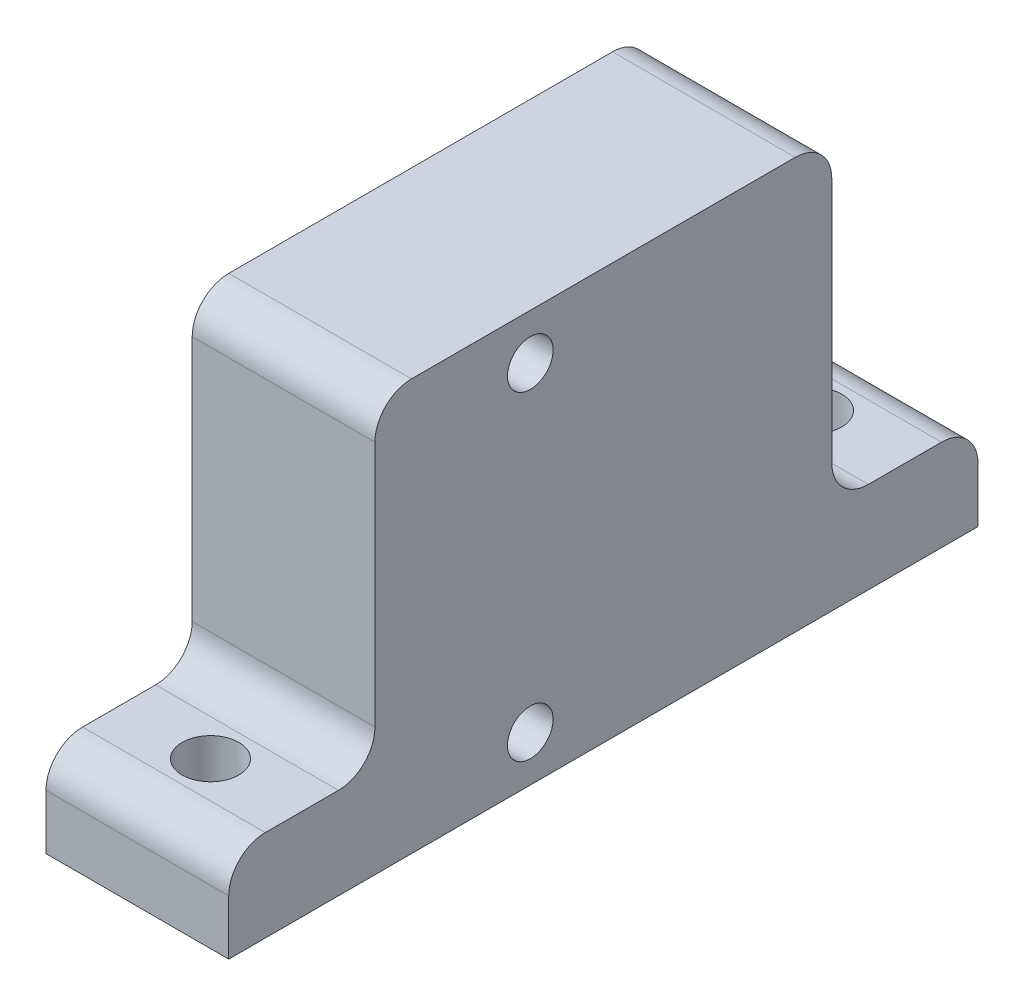
ISO-10303-21;
HEADER;
FILE_DESCRIPTION(('STEP AP214'),'2;1');
FILE_NAME('part.step','',(''),(''),'','','');
FILE_SCHEMA(('AUTOMOTIVE_DESIGN { 1 0 10303 214 1 1 1 1 }'));
ENDSEC;
DATA;
#1=APPLICATION_CONTEXT('core data for automotive mechanical design processes');
#2=APPLICATION_PROTOCOL_DEFINITION('international standard','automotive_design',2000,#1);
#3=PRODUCT_CONTEXT('',#1,'mechanical');
#4=PRODUCT('Part','Part','',(#3));
#5=PRODUCT_RELATED_PRODUCT_CATEGORY('part','',(#4));
#6=PRODUCT_DEFINITION_FORMATION('','',#4);
#7=PRODUCT_DEFINITION_CONTEXT('part definition',#1,'design');
#8=PRODUCT_DEFINITION('design','',#6,#7);
#9=PRODUCT_DEFINITION_SHAPE('','',#8);
#10=(LENGTH_UNIT() NAMED_UNIT(*) SI_UNIT(.MILLI.,.METRE.));
#11=(NAMED_UNIT(*) PLANE_ANGLE_UNIT() SI_UNIT($,.RADIAN.));
#12=(NAMED_UNIT(*) SI_UNIT($,.STERADIAN.) SOLID_ANGLE_UNIT());
#13=UNCERTAINTY_MEASURE_WITH_UNIT(LENGTH_MEASURE(1.E-05),#10,'distance_accuracy_value','');
#14=(GEOMETRIC_REPRESENTATION_CONTEXT(3) GLOBAL_UNCERTAINTY_ASSIGNED_CONTEXT((#13)) GLOBAL_UNIT_ASSIGNED_CONTEXT((#10,
#11,#12)) REPRESENTATION_CONTEXT('',''));
#15=CARTESIAN_POINT('',(0.,0.,0.));
#16=DIRECTION('',(0.,0.,1.));
#17=DIRECTION('',(1.,0.,0.));
#18=AXIS2_PLACEMENT_3D('',#15,#16,#17);
#19=CARTESIAN_POINT('',(10.,11.25,8.5));
#20=DIRECTION('',(0.,0.,-1.));
#21=DIRECTION('',(0.,1.,0.));
#22=AXIS2_PLACEMENT_3D('',#19,#20,#21);
#23=PLANE('',#22);
#24=DIRECTION('',(0.,-1.,0.));
#25=VECTOR('',#24,1.);
#26=CARTESIAN_POINT('',(0.,11.25,8.5));
#27=LINE('',#26,#25);
#28=CARTESIAN_POINT('',(0.,9.25,8.5));
#29=VERTEX_POINT('',#28);
#30=CARTESIAN_POINT('',(0.,-4.24999999999999,8.5));
#31=VERTEX_POINT('',#30);
#32=EDGE_CURVE('E158',#29,#31,#27,.T.);
#33=ORIENTED_EDGE('',*,*,#32,.T.);
#34=DIRECTION('',(-1.,0.,0.));
#35=VECTOR('',#34,1.);
#36=CARTESIAN_POINT('',(10.,-4.25,8.5));
#37=LINE('',#36,#35);
#38=CARTESIAN_POINT('',(10.,-4.24999999999999,8.5));
#39=VERTEX_POINT('',#38);
#40=EDGE_CURVE('E296',#31,#39,#37,.F.);
#41=ORIENTED_EDGE('',*,*,#40,.T.);
#42=DIRECTION('',(0.,-1.,0.));
#43=VECTOR('',#42,1.);
#44=CARTESIAN_POINT('',(10.,11.25,8.5));
#45=LINE('',#44,#43);
#46=CARTESIAN_POINT('',(10.,9.25,8.5));
#47=VERTEX_POINT('',#46);
#48=EDGE_CURVE('E273',#47,#39,#45,.T.);
#49=ORIENTED_EDGE('',*,*,#48,.F.);
#50=DIRECTION('',(-1.,0.,0.));
#51=VECTOR('',#50,1.);
#52=CARTESIAN_POINT('',(10.,9.25,8.5));
#53=LINE('',#52,#51);
#54=EDGE_CURVE('E272',#47,#29,#53,.T.);
#55=ORIENTED_EDGE('',*,*,#54,.T.);
#56=EDGE_LOOP('',(#33,#41,#49,#55));
#57=FACE_BOUND('',#56,.T.);
#58=ADVANCED_FACE('F33',(#57),#23,.F.);
#59=CARTESIAN_POINT('',(10.,11.25,-16.5));
#60=DIRECTION('',(0.,0.,1.));
#61=DIRECTION('',(1.,0.,0.));
#62=AXIS2_PLACEMENT_3D('',#59,#60,#61);
#63=PLANE('',#62);
#64=DIRECTION('',(0.,1.,0.));
#65=VECTOR('',#64,1.);
#66=CARTESIAN_POINT('',(10.,11.25,-16.5));
#67=LINE('',#66,#65);
#68=CARTESIAN_POINT('',(10.,-4.24999999999999,-16.5));
#69=VERTEX_POINT('',#68);
#70=CARTESIAN_POINT('',(10.,9.25,-16.5));
#71=VERTEX_POINT('',#70);
#72=EDGE_CURVE('E157',#69,#71,#67,.T.);
#73=ORIENTED_EDGE('',*,*,#72,.F.);
#74=DIRECTION('',(1.,0.,0.));
#75=VECTOR('',#74,1.);
#76=CARTESIAN_POINT('',(0.,-4.25,-16.5));
#77=LINE('',#76,#75);
#78=CARTESIAN_POINT('',(0.,-4.24999999999999,-16.5));
#79=VERTEX_POINT('',#78);
#80=EDGE_CURVE('E217',#69,#79,#77,.F.);
#81=ORIENTED_EDGE('',*,*,#80,.T.);
#82=DIRECTION('',(0.,1.,0.));
#83=VECTOR('',#82,1.);
#84=CARTESIAN_POINT('',(0.,11.25,-16.5));
#85=LINE('',#84,#83);
#86=CARTESIAN_POINT('',(0.,9.25,-16.5));
#87=VERTEX_POINT('',#86);
#88=EDGE_CURVE('E187',#79,#87,#85,.T.);
#89=ORIENTED_EDGE('',*,*,#88,.T.);
#90=DIRECTION('',(-1.,0.,0.));
#91=VECTOR('',#90,1.);
#92=CARTESIAN_POINT('',(10.,9.25,-16.5));
#93=LINE('',#92,#91);
#94=EDGE_CURVE('E215',#87,#71,#93,.F.);
#95=ORIENTED_EDGE('',*,*,#94,.T.);
#96=EDGE_LOOP('',(#73,#81,#89,#95));
#97=FACE_BOUND('',#96,.T.);
#98=ADVANCED_FACE('F236',(#97),#63,.F.);
#99=CARTESIAN_POINT('',(10.,0.,0.));
#100=DIRECTION('',(1.,0.,0.));
#101=DIRECTION('',(0.,0.,-1.));
#102=AXIS2_PLACEMENT_3D('',#99,#100,#101);
#103=PLANE('',#102);
#104=CARTESIAN_POINT('',(10.,8.75,0.));
#105=DIRECTION('',(1.,0.,0.));
#106=DIRECTION('',(0.,0.,-1.));
#107=AXIS2_PLACEMENT_3D('',#104,#105,#106);
#108=CIRCLE('',#107,1.25);
#109=CARTESIAN_POINT('',(10.,8.75,-1.25));
#110=VERTEX_POINT('',#109);
#111=EDGE_CURVE('E184',#110,#110,#108,.T.);
#112=ORIENTED_EDGE('',*,*,#111,.F.);
#113=EDGE_LOOP('',(#112));
#114=FACE_BOUND('',#113,.T.);
#115=DIRECTION('',(0.,0.,-1.));
#116=VECTOR('',#115,1.);
#117=CARTESIAN_POINT('',(10.,-6.25,16.5));
#118=LINE('',#117,#116);
#119=CARTESIAN_POINT('',(10.,-6.25,14.5));
#120=VERTEX_POINT('',#119);
#121=CARTESIAN_POINT('',(10.,-6.25,10.5));
#122=VERTEX_POINT('',#121);
#123=EDGE_CURVE('E172',#120,#122,#118,.T.);
#124=ORIENTED_EDGE('',*,*,#123,.F.);
#125=CARTESIAN_POINT('',(10.,-8.25,14.5));
#126=DIRECTION('',(1.,0.,0.));
#127=DIRECTION('',(0.,0.,-1.));
#128=AXIS2_PLACEMENT_3D('',#125,#126,#127);
#129=CIRCLE('',#128,2.);
#130=CARTESIAN_POINT('',(10.,-8.25,16.5));
#131=VERTEX_POINT('',#130);
#132=EDGE_CURVE('E205',#120,#131,#129,.T.);
#133=ORIENTED_EDGE('',*,*,#132,.T.);
#134=DIRECTION('',(0.,1.,0.));
#135=VECTOR('',#134,1.);
#136=CARTESIAN_POINT('',(10.,-11.25,16.5));
#137=LINE('',#136,#135);
#138=CARTESIAN_POINT('',(10.,-11.25,16.5));
#139=VERTEX_POINT('',#138);
#140=EDGE_CURVE('E163',#139,#131,#137,.T.);
#141=ORIENTED_EDGE('',*,*,#140,.F.);
#142=DIRECTION('',(0.,0.,-1.));
#143=VECTOR('',#142,1.);
#144=CARTESIAN_POINT('',(10.,-11.25,8.49999999999999));
#145=LINE('',#144,#143);
#146=CARTESIAN_POINT('',(10.,-11.25,-24.5));
#147=VERTEX_POINT('',#146);
#148=EDGE_CURVE('E162',#139,#147,#145,.T.);
#149=ORIENTED_EDGE('',*,*,#148,.T.);
#150=DIRECTION('',(0.,-1.,0.));
#151=VECTOR('',#150,1.);
#152=CARTESIAN_POINT('',(10.,-11.25,-24.5));
#153=LINE('',#152,#151);
#154=CARTESIAN_POINT('',(10.,-8.25,-24.5));
#155=VERTEX_POINT('',#154);
#156=EDGE_CURVE('E169',#155,#147,#153,.T.);
#157=ORIENTED_EDGE('',*,*,#156,.F.);
#158=CARTESIAN_POINT('',(10.,-8.25,-22.5));
#159=DIRECTION('',(1.,0.,0.));
#160=DIRECTION('',(0.,0.,-1.));
#161=AXIS2_PLACEMENT_3D('',#158,#159,#160);
#162=CIRCLE('',#161,2.);
#163=CARTESIAN_POINT('',(10.,-6.25,-22.5));
#164=VERTEX_POINT('',#163);
#165=EDGE_CURVE('E203',#155,#164,#162,.T.);
#166=ORIENTED_EDGE('',*,*,#165,.T.);
#167=DIRECTION('',(0.,0.,1.));
#168=VECTOR('',#167,1.);
#169=CARTESIAN_POINT('',(10.,-6.25,-24.5));
#170=LINE('',#169,#168);
#171=CARTESIAN_POINT('',(10.,-6.25,-18.5));
#172=VERTEX_POINT('',#171);
#173=EDGE_CURVE('E175',#164,#172,#170,.T.);
#174=ORIENTED_EDGE('',*,*,#173,.T.);
#175=CARTESIAN_POINT('',(10.,-4.25,-18.5));
#176=DIRECTION('',(1.,0.,0.));
#177=DIRECTION('',(0.,0.,-1.));
#178=AXIS2_PLACEMENT_3D('',#175,#176,#177);
#179=CIRCLE('',#178,2.);
#180=EDGE_CURVE('E41',#172,#69,#179,.F.);
#181=ORIENTED_EDGE('',*,*,#180,.T.);
#182=ORIENTED_EDGE('',*,*,#72,.T.);
#183=CARTESIAN_POINT('',(10.,9.25,-14.5));
#184=DIRECTION('',(1.,0.,0.));
#185=DIRECTION('',(0.,0.,-1.));
#186=AXIS2_PLACEMENT_3D('',#183,#184,#185);
#187=CIRCLE('',#186,2.);
#188=CARTESIAN_POINT('',(10.,11.25,-14.5));
#189=VERTEX_POINT('',#188);
#190=EDGE_CURVE('E55',#71,#189,#187,.T.);
#191=ORIENTED_EDGE('',*,*,#190,.T.);
#192=DIRECTION('',(0.,0.,1.));
#193=VECTOR('',#192,1.);
#194=CARTESIAN_POINT('',(10.,11.25,8.5));
#195=LINE('',#194,#193);
#196=CARTESIAN_POINT('',(10.,11.25,6.5));
#197=VERTEX_POINT('',#196);
#198=EDGE_CURVE('E192',#189,#197,#195,.T.);
#199=ORIENTED_EDGE('',*,*,#198,.T.);
#200=CARTESIAN_POINT('',(10.,9.25,6.5));
#201=DIRECTION('',(1.,0.,0.));
#202=DIRECTION('',(0.,0.,-1.));
#203=AXIS2_PLACEMENT_3D('',#200,#201,#202);
#204=CIRCLE('',#203,2.);
#205=EDGE_CURVE('E199',#197,#47,#204,.T.);
#206=ORIENTED_EDGE('',*,*,#205,.T.);
#207=ORIENTED_EDGE('',*,*,#48,.T.);
#208=CARTESIAN_POINT('',(10.,-4.25,10.5));
#209=DIRECTION('',(1.,0.,0.));
#210=DIRECTION('',(0.,0.,-1.));
#211=AXIS2_PLACEMENT_3D('',#208,#209,#210);
#212=CIRCLE('',#211,2.);
#213=EDGE_CURVE('E225',#39,#122,#212,.F.);
#214=ORIENTED_EDGE('',*,*,#213,.T.);
#215=EDGE_LOOP('',(#124,#133,#141,#149,#157,#166,#174,#181,#182,#191,#199,#206,#207,#214));
#216=FACE_BOUND('',#215,.T.);
#217=CARTESIAN_POINT('',(10.,-8.75,0.));
#218=DIRECTION('',(1.,0.,0.));
#219=DIRECTION('',(0.,0.,-1.));
#220=AXIS2_PLACEMENT_3D('',#217,#218,#219);
#221=CIRCLE('',#220,1.25);
#222=CARTESIAN_POINT('',(10.,-8.75,-1.25));
#223=VERTEX_POINT('',#222);
#224=EDGE_CURVE('E176',#223,#223,#221,.T.);
#225=ORIENTED_EDGE('',*,*,#224,.F.);
#226=EDGE_LOOP('',(#225));
#227=FACE_BOUND('',#226,.T.);
#228=ADVANCED_FACE('F229',(#114,#216,#227),#103,.T.);
#229=CARTESIAN_POINT('',(0.,0.,0.));
#230=DIRECTION('',(1.,0.,0.));
#231=DIRECTION('',(0.,0.,-1.));
#232=AXIS2_PLACEMENT_3D('',#229,#230,#231);
#233=PLANE('',#232);
#234=DIRECTION('',(0.,-1.,0.));
#235=VECTOR('',#234,1.);
#236=CARTESIAN_POINT('',(0.,-11.25,16.5));
#237=LINE('',#236,#235);
#238=CARTESIAN_POINT('',(0.,-8.25,16.5));
#239=VERTEX_POINT('',#238);
#240=CARTESIAN_POINT('',(0.,-11.25,16.5));
#241=VERTEX_POINT('',#240);
#242=EDGE_CURVE('E136',#239,#241,#237,.T.);
#243=ORIENTED_EDGE('',*,*,#242,.F.);
#244=CARTESIAN_POINT('',(0.,-8.25,14.5));
#245=DIRECTION('',(1.,0.,0.));
#246=DIRECTION('',(0.,0.,-1.));
#247=AXIS2_PLACEMENT_3D('',#244,#245,#246);
#248=CIRCLE('',#247,2.);
#249=CARTESIAN_POINT('',(0.,-6.25,14.5));
#250=VERTEX_POINT('',#249);
#251=EDGE_CURVE('E201',#239,#250,#248,.F.);
#252=ORIENTED_EDGE('',*,*,#251,.T.);
#253=DIRECTION('',(0.,0.,-1.));
#254=VECTOR('',#253,1.);
#255=CARTESIAN_POINT('',(0.,-6.25,16.5));
#256=LINE('',#255,#254);
#257=CARTESIAN_POINT('',(0.,-6.25,10.5));
#258=VERTEX_POINT('',#257);
#259=EDGE_CURVE('E165',#250,#258,#256,.T.);
#260=ORIENTED_EDGE('',*,*,#259,.T.);
#261=CARTESIAN_POINT('',(0.,-4.25,10.5));
#262=DIRECTION('',(1.,0.,0.));
#263=DIRECTION('',(0.,0.,-1.));
#264=AXIS2_PLACEMENT_3D('',#261,#262,#263);
#265=CIRCLE('',#264,2.);
#266=EDGE_CURVE('E223',#258,#31,#265,.T.);
#267=ORIENTED_EDGE('',*,*,#266,.T.);
#268=ORIENTED_EDGE('',*,*,#32,.F.);
#269=CARTESIAN_POINT('',(0.,9.25,6.5));
#270=DIRECTION('',(1.,0.,0.));
#271=DIRECTION('',(0.,0.,-1.));
#272=AXIS2_PLACEMENT_3D('',#269,#270,#271);
#273=CIRCLE('',#272,2.);
#274=CARTESIAN_POINT('',(0.,11.25,6.5));
#275=VERTEX_POINT('',#274);
#276=EDGE_CURVE('E254',#29,#275,#273,.F.);
#277=ORIENTED_EDGE('',*,*,#276,.T.);
#278=DIRECTION('',(0.,0.,1.));
#279=VECTOR('',#278,1.);
#280=CARTESIAN_POINT('',(0.,11.25,8.5));
#281=LINE('',#280,#279);
#282=CARTESIAN_POINT('',(0.,11.25,-14.5));
#283=VERTEX_POINT('',#282);
#284=EDGE_CURVE('E282',#283,#275,#281,.T.);
#285=ORIENTED_EDGE('',*,*,#284,.F.);
#286=CARTESIAN_POINT('',(0.,9.25,-14.5));
#287=DIRECTION('',(1.,0.,0.));
#288=DIRECTION('',(0.,0.,-1.));
#289=AXIS2_PLACEMENT_3D('',#286,#287,#288);
#290=CIRCLE('',#289,2.);
#291=EDGE_CURVE('E289',#283,#87,#290,.F.);
#292=ORIENTED_EDGE('',*,*,#291,.T.);
#293=ORIENTED_EDGE('',*,*,#88,.F.);
#294=CARTESIAN_POINT('',(0.,-4.25,-18.5));
#295=DIRECTION('',(1.,0.,0.));
#296=DIRECTION('',(0.,0.,-1.));
#297=AXIS2_PLACEMENT_3D('',#294,#295,#296);
#298=CIRCLE('',#297,2.);
#299=CARTESIAN_POINT('',(0.,-6.25,-18.5));
#300=VERTEX_POINT('',#299);
#301=EDGE_CURVE('E11',#79,#300,#298,.T.);
#302=ORIENTED_EDGE('',*,*,#301,.T.);
#303=DIRECTION('',(0.,0.,1.));
#304=VECTOR('',#303,1.);
#305=CARTESIAN_POINT('',(0.,-6.25,-24.5));
#306=LINE('',#305,#304);
#307=CARTESIAN_POINT('',(0.,-6.25,-22.5));
#308=VERTEX_POINT('',#307);
#309=EDGE_CURVE('E183',#308,#300,#306,.T.);
#310=ORIENTED_EDGE('',*,*,#309,.F.);
#311=CARTESIAN_POINT('',(0.,-8.25,-22.5));
#312=DIRECTION('',(1.,0.,0.));
#313=DIRECTION('',(0.,0.,-1.));
#314=AXIS2_PLACEMENT_3D('',#311,#312,#313);
#315=CIRCLE('',#314,2.);
#316=CARTESIAN_POINT('',(0.,-8.25,-24.5));
#317=VERTEX_POINT('',#316);
#318=EDGE_CURVE('E295',#308,#317,#315,.F.);
#319=ORIENTED_EDGE('',*,*,#318,.T.);
#320=DIRECTION('',(0.,1.,0.));
#321=VECTOR('',#320,1.);
#322=CARTESIAN_POINT('',(0.,-11.25,-24.5));
#323=LINE('',#322,#321);
#324=CARTESIAN_POINT('',(0.,-11.25,-24.5));
#325=VERTEX_POINT('',#324);
#326=EDGE_CURVE('E153',#325,#317,#323,.T.);
#327=ORIENTED_EDGE('',*,*,#326,.F.);
#328=DIRECTION('',(0.,0.,-1.));
#329=VECTOR('',#328,1.);
#330=CARTESIAN_POINT('',(0.,-11.25,8.49999999999999));
#331=LINE('',#330,#329);
#332=EDGE_CURVE('E149',#241,#325,#331,.T.);
#333=ORIENTED_EDGE('',*,*,#332,.F.);
#334=EDGE_LOOP('',(#243,#252,#260,#267,#268,#277,#285,#292,#293,#302,#310,#319,#327,#333));
#335=FACE_BOUND('',#334,.T.);
#336=CARTESIAN_POINT('',(0.,8.75,0.));
#337=DIRECTION('',(1.,0.,0.));
#338=DIRECTION('',(0.,0.,-1.));
#339=AXIS2_PLACEMENT_3D('',#336,#337,#338);
#340=CIRCLE('',#339,1.25);
#341=CARTESIAN_POINT('',(0.,8.75,-1.25));
#342=VERTEX_POINT('',#341);
#343=EDGE_CURVE('E179',#342,#342,#340,.T.);
#344=ORIENTED_EDGE('',*,*,#343,.T.);
#345=EDGE_LOOP('',(#344));
#346=FACE_BOUND('',#345,.T.);
#347=CARTESIAN_POINT('',(0.,-8.75,0.));
#348=DIRECTION('',(1.,0.,0.));
#349=DIRECTION('',(0.,0.,-1.));
#350=AXIS2_PLACEMENT_3D('',#347,#348,#349);
#351=CIRCLE('',#350,1.25);
#352=CARTESIAN_POINT('',(0.,-8.75,-1.25));
#353=VERTEX_POINT('',#352);
#354=EDGE_CURVE('E180',#353,#353,#351,.T.);
#355=ORIENTED_EDGE('',*,*,#354,.T.);
#356=EDGE_LOOP('',(#355));
#357=FACE_BOUND('',#356,.T.);
#358=ADVANCED_FACE('F150',(#335,#346,#357),#233,.F.);
#359=CARTESIAN_POINT('',(10.,11.25,8.5));
#360=DIRECTION('',(0.,-1.,0.));
#361=DIRECTION('',(0.,0.,-1.));
#362=AXIS2_PLACEMENT_3D('',#359,#360,#361);
#363=PLANE('',#362);
#364=ORIENTED_EDGE('',*,*,#198,.F.);
#365=DIRECTION('',(-1.,0.,0.));
#366=VECTOR('',#365,1.);
#367=CARTESIAN_POINT('',(10.,11.25,-14.5));
#368=LINE('',#367,#366);
#369=EDGE_CURVE('E220',#189,#283,#368,.T.);
#370=ORIENTED_EDGE('',*,*,#369,.T.);
#371=ORIENTED_EDGE('',*,*,#284,.T.);
#372=DIRECTION('',(-1.,0.,0.));
#373=VECTOR('',#372,1.);
#374=CARTESIAN_POINT('',(10.,11.25,6.5));
#375=LINE('',#374,#373);
#376=EDGE_CURVE('E48',#275,#197,#375,.F.);
#377=ORIENTED_EDGE('',*,*,#376,.T.);
#378=EDGE_LOOP('',(#364,#370,#371,#377));
#379=FACE_BOUND('',#378,.T.);
#380=ADVANCED_FACE('F290',(#379),#363,.F.);
#381=CARTESIAN_POINT('',(10.,-11.25,8.49999999999999));
#382=DIRECTION('',(0.,1.,0.));
#383=DIRECTION('',(0.,0.,1.));
#384=AXIS2_PLACEMENT_3D('',#381,#382,#383);
#385=PLANE('',#384);
#386=CARTESIAN_POINT('',(5.,-11.25,-20.5));
#387=DIRECTION('',(0.,1.,0.));
#388=DIRECTION('',(0.,0.,1.));
#389=AXIS2_PLACEMENT_3D('',#386,#387,#388);
#390=CIRCLE('',#389,1.55);
#391=CARTESIAN_POINT('',(5.,-11.25,-18.95));
#392=VERTEX_POINT('',#391);
#393=EDGE_CURVE('E382',#392,#392,#390,.F.);
#394=ORIENTED_EDGE('',*,*,#393,.F.);
#395=EDGE_LOOP('',(#394));
#396=FACE_BOUND('',#395,.T.);
#397=CARTESIAN_POINT('',(5.,-11.25,12.5));
#398=DIRECTION('',(0.,1.,0.));
#399=DIRECTION('',(0.,0.,1.));
#400=AXIS2_PLACEMENT_3D('',#397,#398,#399);
#401=CIRCLE('',#400,1.55);
#402=CARTESIAN_POINT('',(5.,-11.25,14.05));
#403=VERTEX_POINT('',#402);
#404=EDGE_CURVE('E146',#403,#403,#401,.F.);
#405=ORIENTED_EDGE('',*,*,#404,.F.);
#406=EDGE_LOOP('',(#405));
#407=FACE_BOUND('',#406,.T.);
#408=ORIENTED_EDGE('',*,*,#332,.T.);
#409=DIRECTION('',(-1.,0.,0.));
#410=VECTOR('',#409,1.);
#411=CARTESIAN_POINT('',(10.,-11.25,-24.5));
#412=LINE('',#411,#410);
#413=EDGE_CURVE('E171',#147,#325,#412,.T.);
#414=ORIENTED_EDGE('',*,*,#413,.F.);
#415=ORIENTED_EDGE('',*,*,#148,.F.);
#416=DIRECTION('',(1.,0.,0.));
#417=VECTOR('',#416,1.);
#418=CARTESIAN_POINT('',(0.,-11.25,16.5));
#419=LINE('',#418,#417);
#420=EDGE_CURVE('E141',#241,#139,#419,.T.);
#421=ORIENTED_EDGE('',*,*,#420,.F.);
#422=EDGE_LOOP('',(#408,#414,#415,#421));
#423=FACE_BOUND('',#422,.T.);
#424=ADVANCED_FACE('F160',(#396,#407,#423),#385,.F.);
#425=CARTESIAN_POINT('',(10.,8.75,0.));
#426=DIRECTION('',(-1.,0.,0.));
#427=DIRECTION('',(0.,0.,1.));
#428=AXIS2_PLACEMENT_3D('',#425,#426,#427);
#429=CYLINDRICAL_SURFACE('',#428,1.25);
#430=ORIENTED_EDGE('',*,*,#111,.T.);
#431=EDGE_LOOP('',(#430));
#432=FACE_BOUND('',#431,.T.);
#433=ORIENTED_EDGE('',*,*,#343,.F.);
#434=EDGE_LOOP('',(#433));
#435=FACE_BOUND('',#434,.T.);
#436=ADVANCED_FACE('F342',(#432,#435),#429,.F.);
#437=CARTESIAN_POINT('',(10.,-8.75,0.));
#438=DIRECTION('',(-1.,0.,0.));
#439=DIRECTION('',(0.,0.,1.));
#440=AXIS2_PLACEMENT_3D('',#437,#438,#439);
#441=CYLINDRICAL_SURFACE('',#440,1.25);
#442=ORIENTED_EDGE('',*,*,#224,.T.);
#443=EDGE_LOOP('',(#442));
#444=FACE_BOUND('',#443,.T.);
#445=ORIENTED_EDGE('',*,*,#354,.F.);
#446=EDGE_LOOP('',(#445));
#447=FACE_BOUND('',#446,.T.);
#448=ADVANCED_FACE('F352',(#444,#447),#441,.F.);
#449=CARTESIAN_POINT('',(10.,-6.25,-24.5));
#450=DIRECTION('',(0.,-1.,0.));
#451=DIRECTION('',(0.,0.,-1.));
#452=AXIS2_PLACEMENT_3D('',#449,#450,#451);
#453=PLANE('',#452);
#454=CARTESIAN_POINT('',(5.,-6.25,-20.5));
#455=DIRECTION('',(0.,1.,0.));
#456=DIRECTION('',(0.,0.,1.));
#457=AXIS2_PLACEMENT_3D('',#454,#455,#456);
#458=CIRCLE('',#457,1.55);
#459=CARTESIAN_POINT('',(5.,-6.25,-18.95));
#460=VERTEX_POINT('',#459);
#461=EDGE_CURVE('E379',#460,#460,#458,.T.);
#462=ORIENTED_EDGE('',*,*,#461,.F.);
#463=EDGE_LOOP('',(#462));
#464=FACE_BOUND('',#463,.T.);
#465=ORIENTED_EDGE('',*,*,#173,.F.);
#466=DIRECTION('',(1.,0.,0.));
#467=VECTOR('',#466,1.);
#468=CARTESIAN_POINT('',(10.,-6.25,-22.5));
#469=LINE('',#468,#467);
#470=EDGE_CURVE('E213',#164,#308,#469,.F.);
#471=ORIENTED_EDGE('',*,*,#470,.T.);
#472=ORIENTED_EDGE('',*,*,#309,.T.);
#473=DIRECTION('',(1.,0.,0.));
#474=VECTOR('',#473,1.);
#475=CARTESIAN_POINT('',(10.,-6.25,-18.5));
#476=LINE('',#475,#474);
#477=EDGE_CURVE('E210',#300,#172,#476,.T.);
#478=ORIENTED_EDGE('',*,*,#477,.T.);
#479=EDGE_LOOP('',(#465,#471,#472,#478));
#480=FACE_BOUND('',#479,.T.);
#481=ADVANCED_FACE('F246',(#464,#480),#453,.F.);
#482=CARTESIAN_POINT('',(0.,0.,-24.5));
#483=DIRECTION('',(0.,0.,1.));
#484=DIRECTION('',(1.,0.,0.));
#485=AXIS2_PLACEMENT_3D('',#482,#483,#484);
#486=PLANE('',#485);
#487=ORIENTED_EDGE('',*,*,#326,.T.);
#488=DIRECTION('',(1.,0.,0.));
#489=VECTOR('',#488,1.);
#490=CARTESIAN_POINT('',(0.,-8.25,-24.5));
#491=LINE('',#490,#489);
#492=EDGE_CURVE('E207',#317,#155,#491,.T.);
#493=ORIENTED_EDGE('',*,*,#492,.T.);
#494=ORIENTED_EDGE('',*,*,#156,.T.);
#495=ORIENTED_EDGE('',*,*,#413,.T.);
#496=EDGE_LOOP('',(#487,#493,#494,#495));
#497=FACE_BOUND('',#496,.T.);
#498=ADVANCED_FACE('F315',(#497),#486,.F.);
#499=CARTESIAN_POINT('',(0.,-6.25,16.5));
#500=DIRECTION('',(0.,-1.,0.));
#501=DIRECTION('',(1.,0.,0.));
#502=AXIS2_PLACEMENT_3D('',#499,#500,#501);
#503=PLANE('',#502);
#504=CARTESIAN_POINT('',(5.,-6.25,12.5));
#505=DIRECTION('',(0.,1.,0.));
#506=DIRECTION('',(-1.,0.,0.));
#507=AXIS2_PLACEMENT_3D('',#504,#505,#506);
#508=CIRCLE('',#507,1.55);
#509=CARTESIAN_POINT('',(3.45,-6.25,12.5));
#510=VERTEX_POINT('',#509);
#511=EDGE_CURVE('E383',#510,#510,#508,.T.);
#512=ORIENTED_EDGE('',*,*,#511,.F.);
#513=EDGE_LOOP('',(#512));
#514=FACE_BOUND('',#513,.T.);
#515=ORIENTED_EDGE('',*,*,#123,.T.);
#516=DIRECTION('',(-1.,0.,0.));
#517=VECTOR('',#516,1.);
#518=CARTESIAN_POINT('',(0.,-6.25,10.5));
#519=LINE('',#518,#517);
#520=EDGE_CURVE('E269',#122,#258,#519,.T.);
#521=ORIENTED_EDGE('',*,*,#520,.T.);
#522=ORIENTED_EDGE('',*,*,#259,.F.);
#523=DIRECTION('',(-1.,0.,0.));
#524=VECTOR('',#523,1.);
#525=CARTESIAN_POINT('',(0.,-6.25,14.5));
#526=LINE('',#525,#524);
#527=EDGE_CURVE('E267',#250,#120,#526,.F.);
#528=ORIENTED_EDGE('',*,*,#527,.T.);
#529=EDGE_LOOP('',(#515,#521,#522,#528));
#530=FACE_BOUND('',#529,.T.);
#531=ADVANCED_FACE('F308',(#514,#530),#503,.F.);
#532=CARTESIAN_POINT('',(0.,0.,16.5));
#533=DIRECTION('',(0.,0.,-1.));
#534=DIRECTION('',(-1.,0.,0.));
#535=AXIS2_PLACEMENT_3D('',#532,#533,#534);
#536=PLANE('',#535);
#537=ORIENTED_EDGE('',*,*,#140,.T.);
#538=DIRECTION('',(-1.,0.,0.));
#539=VECTOR('',#538,1.);
#540=CARTESIAN_POINT('',(0.,-8.25,16.5));
#541=LINE('',#540,#539);
#542=EDGE_CURVE('E144',#131,#239,#541,.T.);
#543=ORIENTED_EDGE('',*,*,#542,.T.);
#544=ORIENTED_EDGE('',*,*,#242,.T.);
#545=ORIENTED_EDGE('',*,*,#420,.T.);
#546=EDGE_LOOP('',(#537,#543,#544,#545));
#547=FACE_BOUND('',#546,.T.);
#548=ADVANCED_FACE('F139',(#547),#536,.F.);
#549=CARTESIAN_POINT('',(0.,-4.25,10.5));
#550=DIRECTION('',(1.,0.,0.));
#551=DIRECTION('',(0.,1.,0.));
#552=AXIS2_PLACEMENT_3D('',#549,#550,#551);
#553=CYLINDRICAL_SURFACE('',#552,2.);
#554=ORIENTED_EDGE('',*,*,#213,.F.);
#555=ORIENTED_EDGE('',*,*,#40,.F.);
#556=ORIENTED_EDGE('',*,*,#266,.F.);
#557=ORIENTED_EDGE('',*,*,#520,.F.);
#558=EDGE_LOOP('',(#554,#555,#556,#557));
#559=FACE_BOUND('',#558,.T.);
#560=ADVANCED_FACE('F305',(#559),#553,.F.);
#561=CARTESIAN_POINT('',(0.,-8.25,14.5));
#562=DIRECTION('',(-1.,0.,0.));
#563=DIRECTION('',(0.,-1.,0.));
#564=AXIS2_PLACEMENT_3D('',#561,#562,#563);
#565=CYLINDRICAL_SURFACE('',#564,2.);
#566=ORIENTED_EDGE('',*,*,#132,.F.);
#567=ORIENTED_EDGE('',*,*,#527,.F.);
#568=ORIENTED_EDGE('',*,*,#251,.F.);
#569=ORIENTED_EDGE('',*,*,#542,.F.);
#570=EDGE_LOOP('',(#566,#567,#568,#569));
#571=FACE_BOUND('',#570,.T.);
#572=ADVANCED_FACE('F319',(#571),#565,.T.);
#573=CARTESIAN_POINT('',(0.,-8.25,-22.5));
#574=DIRECTION('',(1.,0.,0.));
#575=DIRECTION('',(0.,0.,-1.));
#576=AXIS2_PLACEMENT_3D('',#573,#574,#575);
#577=CYLINDRICAL_SURFACE('',#576,2.);
#578=ORIENTED_EDGE('',*,*,#318,.F.);
#579=ORIENTED_EDGE('',*,*,#470,.F.);
#580=ORIENTED_EDGE('',*,*,#165,.F.);
#581=ORIENTED_EDGE('',*,*,#492,.F.);
#582=EDGE_LOOP('',(#578,#579,#580,#581));
#583=FACE_BOUND('',#582,.T.);
#584=ADVANCED_FACE('F317',(#583),#577,.T.);
#585=CARTESIAN_POINT('',(10.,-4.25,-18.5));
#586=DIRECTION('',(-1.,0.,0.));
#587=DIRECTION('',(0.,0.,1.));
#588=AXIS2_PLACEMENT_3D('',#585,#586,#587);
#589=CYLINDRICAL_SURFACE('',#588,2.);
#590=ORIENTED_EDGE('',*,*,#301,.F.);
#591=ORIENTED_EDGE('',*,*,#80,.F.);
#592=ORIENTED_EDGE('',*,*,#180,.F.);
#593=ORIENTED_EDGE('',*,*,#477,.F.);
#594=EDGE_LOOP('',(#590,#591,#592,#593));
#595=FACE_BOUND('',#594,.T.);
#596=ADVANCED_FACE('F241',(#595),#589,.F.);
#597=CARTESIAN_POINT('',(10.,9.25,-14.5));
#598=DIRECTION('',(-1.,0.,0.));
#599=DIRECTION('',(0.,0.,1.));
#600=AXIS2_PLACEMENT_3D('',#597,#598,#599);
#601=CYLINDRICAL_SURFACE('',#600,2.);
#602=ORIENTED_EDGE('',*,*,#190,.F.);
#603=ORIENTED_EDGE('',*,*,#94,.F.);
#604=ORIENTED_EDGE('',*,*,#291,.F.);
#605=ORIENTED_EDGE('',*,*,#369,.F.);
#606=EDGE_LOOP('',(#602,#603,#604,#605));
#607=FACE_BOUND('',#606,.T.);
#608=ADVANCED_FACE('F287',(#607),#601,.T.);
#609=CARTESIAN_POINT('',(10.,9.25,6.5));
#610=DIRECTION('',(-1.,0.,0.));
#611=DIRECTION('',(0.,0.,1.));
#612=AXIS2_PLACEMENT_3D('',#609,#610,#611);
#613=CYLINDRICAL_SURFACE('',#612,2.);
#614=ORIENTED_EDGE('',*,*,#205,.F.);
#615=ORIENTED_EDGE('',*,*,#376,.F.);
#616=ORIENTED_EDGE('',*,*,#276,.F.);
#617=ORIENTED_EDGE('',*,*,#54,.F.);
#618=EDGE_LOOP('',(#614,#615,#616,#617));
#619=FACE_BOUND('',#618,.T.);
#620=ADVANCED_FACE('F35',(#619),#613,.T.);
#621=CARTESIAN_POINT('',(5.,-11.251,12.5));
#622=DIRECTION('',(0.,1.,0.));
#623=DIRECTION('',(-1.,0.,0.));
#624=AXIS2_PLACEMENT_3D('',#621,#622,#623);
#625=CYLINDRICAL_SURFACE('',#624,1.55);
#626=ORIENTED_EDGE('',*,*,#511,.T.);
#627=EDGE_LOOP('',(#626));
#628=FACE_BOUND('',#627,.T.);
#629=ORIENTED_EDGE('',*,*,#404,.T.);
#630=EDGE_LOOP('',(#629));
#631=FACE_BOUND('',#630,.T.);
#632=ADVANCED_FACE('F367',(#628,#631),#625,.F.);
#633=CARTESIAN_POINT('',(5.,-11.251,-20.5));
#634=DIRECTION('',(0.,1.,0.));
#635=DIRECTION('',(0.,0.,1.));
#636=AXIS2_PLACEMENT_3D('',#633,#634,#635);
#637=CYLINDRICAL_SURFACE('',#636,1.55);
#638=ORIENTED_EDGE('',*,*,#461,.T.);
#639=EDGE_LOOP('',(#638));
#640=FACE_BOUND('',#639,.T.);
#641=ORIENTED_EDGE('',*,*,#393,.T.);
#642=EDGE_LOOP('',(#641));
#643=FACE_BOUND('',#642,.T.);
#644=ADVANCED_FACE('F370',(#640,#643),#637,.F.);
#645=CLOSED_SHELL('',(#58,#98,#228,#358,#380,#424,#436,#448,#481,#498,#531,#548,#560,#572,#584,
#596,#608,#620,#632,#644));
#646=MANIFOLD_SOLID_BREP('B2',#645);
#647=ADVANCED_BREP_SHAPE_REPRESENTATION('',(#18,#646),#14);
#648=SHAPE_DEFINITION_REPRESENTATION(#9,#647);
ENDSEC;
END-ISO-10303-21;
